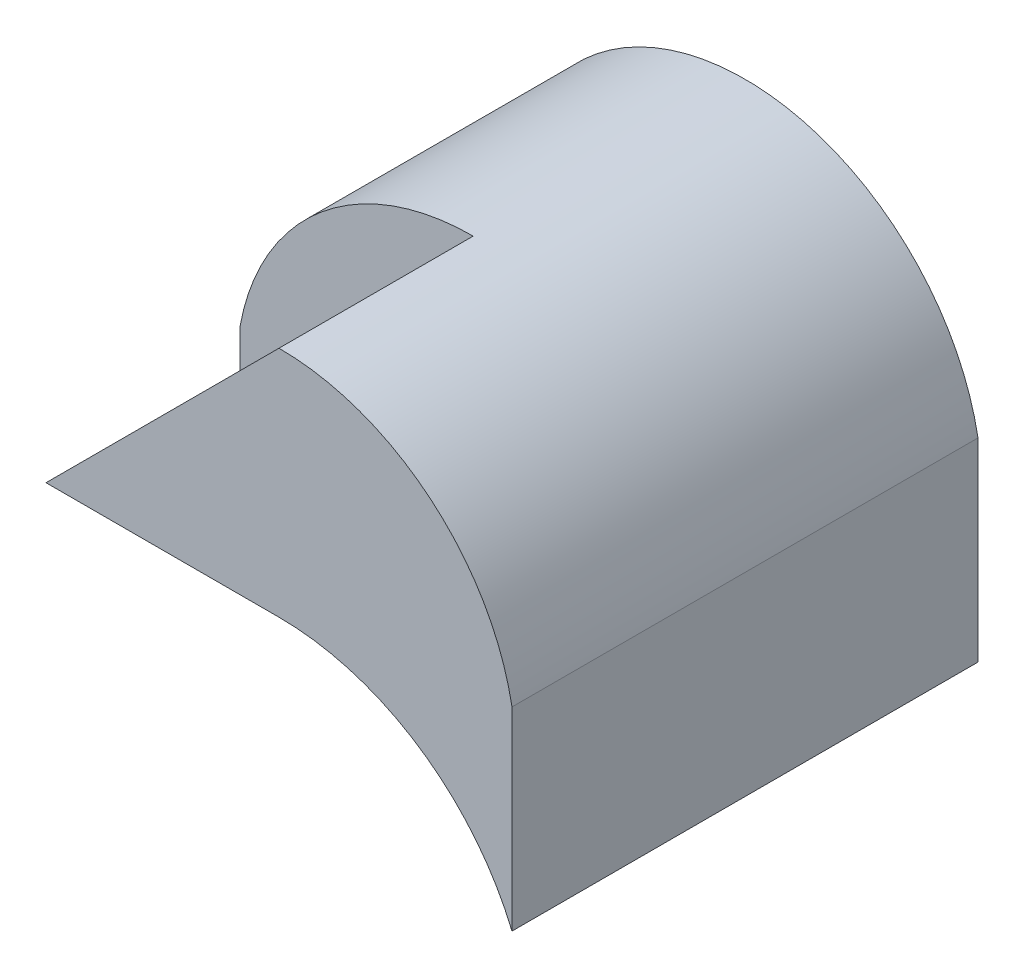
ISO-10303-21;
HEADER;
FILE_DESCRIPTION(('STEP AP214'),'2;1');
FILE_NAME('part.step','',(''),(''),'','','');
FILE_SCHEMA(('AUTOMOTIVE_DESIGN { 1 0 10303 214 1 1 1 1 }'));
ENDSEC;
DATA;
#1=APPLICATION_CONTEXT('core data for automotive mechanical design processes');
#2=APPLICATION_PROTOCOL_DEFINITION('international standard','automotive_design',2000,#1);
#3=PRODUCT_CONTEXT('',#1,'mechanical');
#4=PRODUCT('Part','Part','',(#3));
#5=PRODUCT_RELATED_PRODUCT_CATEGORY('part','',(#4));
#6=PRODUCT_DEFINITION_FORMATION('','',#4);
#7=PRODUCT_DEFINITION_CONTEXT('part definition',#1,'design');
#8=PRODUCT_DEFINITION('design','',#6,#7);
#9=PRODUCT_DEFINITION_SHAPE('','',#8);
#10=(LENGTH_UNIT() NAMED_UNIT(*) SI_UNIT(.MILLI.,.METRE.));
#11=(NAMED_UNIT(*) PLANE_ANGLE_UNIT() SI_UNIT($,.RADIAN.));
#12=(NAMED_UNIT(*) SI_UNIT($,.STERADIAN.) SOLID_ANGLE_UNIT());
#13=UNCERTAINTY_MEASURE_WITH_UNIT(LENGTH_MEASURE(1.E-05),#10,'distance_accuracy_value','');
#14=(GEOMETRIC_REPRESENTATION_CONTEXT(3) GLOBAL_UNCERTAINTY_ASSIGNED_CONTEXT((#13)) GLOBAL_UNIT_ASSIGNED_CONTEXT((#10,
#11,#12)) REPRESENTATION_CONTEXT('',''));
#15=CARTESIAN_POINT('',(0.,0.,0.));
#16=DIRECTION('',(0.,0.,1.));
#17=DIRECTION('',(1.,0.,0.));
#18=AXIS2_PLACEMENT_3D('',#15,#16,#17);
#19=CARTESIAN_POINT('',(-3.,5.,3.));
#20=DIRECTION('',(0.,0.,-1.));
#21=DIRECTION('',(-1.,0.,0.));
#22=AXIS2_PLACEMENT_3D('',#19,#20,#21);
#23=PLANE('',#22);
#24=DIRECTION('',(1.,0.,0.));
#25=VECTOR('',#24,1.);
#26=CARTESIAN_POINT('',(0.,2.,3.));
#27=LINE('',#26,#25);
#28=CARTESIAN_POINT('',(-3.,2.,3.));
#29=VERTEX_POINT('',#28);
#30=CARTESIAN_POINT('',(0.,2.,3.));
#31=VERTEX_POINT('',#30);
#32=EDGE_CURVE('E117',#29,#31,#27,.T.);
#33=ORIENTED_EDGE('',*,*,#32,.T.);
#34=CARTESIAN_POINT('',(0.,-1.25,3.));
#35=DIRECTION('',(0.,0.,1.));
#36=DIRECTION('',(1.,0.,0.));
#37=AXIS2_PLACEMENT_3D('',#34,#35,#36);
#38=CIRCLE('',#37,3.25);
#39=CARTESIAN_POINT('',(3.,0.,3.));
#40=VERTEX_POINT('',#39);
#41=EDGE_CURVE('E152',#31,#40,#38,.F.);
#42=ORIENTED_EDGE('',*,*,#41,.T.);
#43=DIRECTION('',(0.,-1.,0.));
#44=VECTOR('',#43,1.);
#45=CARTESIAN_POINT('',(3.,5.,3.));
#46=LINE('',#45,#44);
#47=CARTESIAN_POINT('',(3.,2.5,3.));
#48=VERTEX_POINT('',#47);
#49=EDGE_CURVE('E166',#48,#40,#46,.T.);
#50=ORIENTED_EDGE('',*,*,#49,.F.);
#51=CARTESIAN_POINT('',(0.,1.95,3.));
#52=DIRECTION('',(0.,0.,1.));
#53=DIRECTION('',(1.,0.,0.));
#54=AXIS2_PLACEMENT_3D('',#51,#52,#53);
#55=CIRCLE('',#54,3.05);
#56=CARTESIAN_POINT('',(0.,5.,3.));
#57=VERTEX_POINT('',#56);
#58=EDGE_CURVE('E157',#57,#48,#55,.F.);
#59=ORIENTED_EDGE('',*,*,#58,.F.);
#60=DIRECTION('',(0.707106781186547,0.707106781186548,0.));
#61=VECTOR('',#60,1.);
#62=CARTESIAN_POINT('',(-2.5,2.5,3.));
#63=LINE('',#62,#61);
#64=EDGE_CURVE('E144',#29,#57,#63,.T.);
#65=ORIENTED_EDGE('',*,*,#64,.F.);
#66=EDGE_LOOP('',(#33,#42,#50,#59,#65));
#67=FACE_BOUND('',#66,.T.);
#68=ADVANCED_FACE('F51',(#67),#23,.F.);
#69=CARTESIAN_POINT('',(-3.,5.,3.));
#70=DIRECTION('',(1.,0.,0.));
#71=DIRECTION('',(0.,0.,-1.));
#72=AXIS2_PLACEMENT_3D('',#69,#70,#71);
#73=PLANE('',#72);
#74=DIRECTION('',(0.,-1.,0.));
#75=VECTOR('',#74,1.);
#76=CARTESIAN_POINT('',(-3.,0.,0.5));
#77=LINE('',#76,#75);
#78=CARTESIAN_POINT('',(-3.,2.,0.5));
#79=VERTEX_POINT('',#78);
#80=CARTESIAN_POINT('',(-3.,0.,0.5));
#81=VERTEX_POINT('',#80);
#82=EDGE_CURVE('E126',#79,#81,#77,.T.);
#83=ORIENTED_EDGE('',*,*,#82,.F.);
#84=DIRECTION('',(0.,-1.,0.));
#85=VECTOR('',#84,1.);
#86=CARTESIAN_POINT('',(-3.,0.,0.5));
#87=LINE('',#86,#85);
#88=CARTESIAN_POINT('',(-3.,2.5,0.5));
#89=VERTEX_POINT('',#88);
#90=EDGE_CURVE('E135',#89,#79,#87,.T.);
#91=ORIENTED_EDGE('',*,*,#90,.F.);
#92=DIRECTION('',(0.,0.,1.));
#93=VECTOR('',#92,1.);
#94=CARTESIAN_POINT('',(-3.,2.5,-9.5));
#95=LINE('',#94,#93);
#96=CARTESIAN_POINT('',(-3.,2.5,-3.));
#97=VERTEX_POINT('',#96);
#98=EDGE_CURVE('E159',#97,#89,#95,.T.);
#99=ORIENTED_EDGE('',*,*,#98,.F.);
#100=DIRECTION('',(0.,-1.,0.));
#101=VECTOR('',#100,1.);
#102=CARTESIAN_POINT('',(-3.,5.,-3.));
#103=LINE('',#102,#101);
#104=CARTESIAN_POINT('',(-3.,0.,-3.));
#105=VERTEX_POINT('',#104);
#106=EDGE_CURVE('E169',#97,#105,#103,.T.);
#107=ORIENTED_EDGE('',*,*,#106,.T.);
#108=DIRECTION('',(0.,0.,1.));
#109=VECTOR('',#108,1.);
#110=CARTESIAN_POINT('',(-3.,0.,3.));
#111=LINE('',#110,#109);
#112=EDGE_CURVE('E137',#105,#81,#111,.T.);
#113=ORIENTED_EDGE('',*,*,#112,.T.);
#114=EDGE_LOOP('',(#83,#91,#99,#107,#113));
#115=FACE_BOUND('',#114,.T.);
#116=ADVANCED_FACE('F134',(#115),#73,.F.);
#117=CARTESIAN_POINT('',(-3.,5.,-3.));
#118=DIRECTION('',(0.,0.,1.));
#119=DIRECTION('',(1.,0.,0.));
#120=AXIS2_PLACEMENT_3D('',#117,#118,#119);
#121=PLANE('',#120);
#122=CARTESIAN_POINT('',(0.,1.95,-3.));
#123=DIRECTION('',(0.,0.,1.));
#124=DIRECTION('',(1.,0.,0.));
#125=AXIS2_PLACEMENT_3D('',#122,#123,#124);
#126=CIRCLE('',#125,3.05);
#127=CARTESIAN_POINT('',(3.,2.5,-3.));
#128=VERTEX_POINT('',#127);
#129=EDGE_CURVE('E74',#97,#128,#126,.F.);
#130=ORIENTED_EDGE('',*,*,#129,.T.);
#131=DIRECTION('',(0.,-1.,0.));
#132=VECTOR('',#131,1.);
#133=CARTESIAN_POINT('',(3.,5.,-3.));
#134=LINE('',#133,#132);
#135=CARTESIAN_POINT('',(3.,0.,-3.));
#136=VERTEX_POINT('',#135);
#137=EDGE_CURVE('E59',#128,#136,#134,.T.);
#138=ORIENTED_EDGE('',*,*,#137,.T.);
#139=CARTESIAN_POINT('',(0.,-1.25,-3.));
#140=DIRECTION('',(0.,0.,1.));
#141=DIRECTION('',(1.,0.,0.));
#142=AXIS2_PLACEMENT_3D('',#139,#140,#141);
#143=CIRCLE('',#142,3.25);
#144=EDGE_CURVE('E155',#105,#136,#143,.F.);
#145=ORIENTED_EDGE('',*,*,#144,.F.);
#146=ORIENTED_EDGE('',*,*,#106,.F.);
#147=EDGE_LOOP('',(#130,#138,#145,#146));
#148=FACE_BOUND('',#147,.T.);
#149=ADVANCED_FACE('F174',(#148),#121,.F.);
#150=CARTESIAN_POINT('',(3.,5.,3.));
#151=DIRECTION('',(-1.,0.,0.));
#152=DIRECTION('',(0.,0.,1.));
#153=AXIS2_PLACEMENT_3D('',#150,#151,#152);
#154=PLANE('',#153);
#155=ORIENTED_EDGE('',*,*,#137,.F.);
#156=DIRECTION('',(0.,0.,1.));
#157=VECTOR('',#156,1.);
#158=CARTESIAN_POINT('',(3.,2.5,-9.5));
#159=LINE('',#158,#157);
#160=EDGE_CURVE('E12',#128,#48,#159,.T.);
#161=ORIENTED_EDGE('',*,*,#160,.T.);
#162=ORIENTED_EDGE('',*,*,#49,.T.);
#163=DIRECTION('',(0.,0.,-1.));
#164=VECTOR('',#163,1.);
#165=CARTESIAN_POINT('',(3.,0.,3.));
#166=LINE('',#165,#164);
#167=EDGE_CURVE('E162',#40,#136,#166,.T.);
#168=ORIENTED_EDGE('',*,*,#167,.T.);
#169=EDGE_LOOP('',(#155,#161,#162,#168));
#170=FACE_BOUND('',#169,.T.);
#171=ADVANCED_FACE('F53',(#170),#154,.F.);
#172=CARTESIAN_POINT('',(0.,1.95,-9.5));
#173=DIRECTION('',(0.,0.,1.));
#174=DIRECTION('',(1.,0.,0.));
#175=AXIS2_PLACEMENT_3D('',#172,#173,#174);
#176=CYLINDRICAL_SURFACE('',#175,3.05);
#177=CARTESIAN_POINT('',(0.,1.95,0.5));
#178=DIRECTION('',(0.,0.,1.));
#179=DIRECTION('',(1.,0.,0.));
#180=AXIS2_PLACEMENT_3D('',#177,#178,#179);
#181=CIRCLE('',#180,3.05);
#182=CARTESIAN_POINT('',(0.,5.,0.5));
#183=VERTEX_POINT('',#182);
#184=EDGE_CURVE('E121',#183,#89,#181,.T.);
#185=ORIENTED_EDGE('',*,*,#184,.F.);
#186=DIRECTION('',(0.,0.,1.));
#187=VECTOR('',#186,1.);
#188=CARTESIAN_POINT('',(0.,5.,0.5));
#189=LINE('',#188,#187);
#190=EDGE_CURVE('E120',#183,#57,#189,.T.);
#191=ORIENTED_EDGE('',*,*,#190,.T.);
#192=ORIENTED_EDGE('',*,*,#58,.T.);
#193=ORIENTED_EDGE('',*,*,#160,.F.);
#194=ORIENTED_EDGE('',*,*,#129,.F.);
#195=ORIENTED_EDGE('',*,*,#98,.T.);
#196=EDGE_LOOP('',(#185,#191,#192,#193,#194,#195));
#197=FACE_BOUND('',#196,.T.);
#198=ADVANCED_FACE('F185',(#197),#176,.T.);
#199=CARTESIAN_POINT('',(0.,-1.25,-9.5));
#200=DIRECTION('',(0.,0.,1.));
#201=DIRECTION('',(1.,0.,0.));
#202=AXIS2_PLACEMENT_3D('',#199,#200,#201);
#203=CYLINDRICAL_SURFACE('',#202,3.25);
#204=DIRECTION('',(0.,0.,1.));
#205=VECTOR('',#204,1.);
#206=CARTESIAN_POINT('',(0.,2.,0.5));
#207=LINE('',#206,#205);
#208=CARTESIAN_POINT('',(0.,2.,0.5));
#209=VERTEX_POINT('',#208);
#210=EDGE_CURVE('E146',#209,#31,#207,.T.);
#211=ORIENTED_EDGE('',*,*,#210,.F.);
#212=CARTESIAN_POINT('',(0.,-1.25,0.5));
#213=DIRECTION('',(0.,0.,1.));
#214=DIRECTION('',(1.,0.,0.));
#215=AXIS2_PLACEMENT_3D('',#212,#213,#214);
#216=CIRCLE('',#215,3.25);
#217=EDGE_CURVE('E128',#81,#209,#216,.F.);
#218=ORIENTED_EDGE('',*,*,#217,.F.);
#219=ORIENTED_EDGE('',*,*,#112,.F.);
#220=ORIENTED_EDGE('',*,*,#144,.T.);
#221=ORIENTED_EDGE('',*,*,#167,.F.);
#222=ORIENTED_EDGE('',*,*,#41,.F.);
#223=EDGE_LOOP('',(#211,#218,#219,#220,#221,#222));
#224=FACE_BOUND('',#223,.T.);
#225=ADVANCED_FACE('F181',(#224),#203,.F.);
#226=CARTESIAN_POINT('',(-2.5,2.5,0.5));
#227=DIRECTION('',(0.707106781186548,-0.707106781186547,0.));
#228=DIRECTION('',(0.707106781186547,0.707106781186548,0.));
#229=AXIS2_PLACEMENT_3D('',#226,#227,#228);
#230=PLANE('',#229);
#231=ORIENTED_EDGE('',*,*,#64,.T.);
#232=ORIENTED_EDGE('',*,*,#190,.F.);
#233=DIRECTION('',(0.707106781186547,0.707106781186548,0.));
#234=VECTOR('',#233,1.);
#235=CARTESIAN_POINT('',(-2.5,2.5,0.5));
#236=LINE('',#235,#234);
#237=EDGE_CURVE('E66',#79,#183,#236,.T.);
#238=ORIENTED_EDGE('',*,*,#237,.F.);
#239=DIRECTION('',(0.,0.,1.));
#240=VECTOR('',#239,1.);
#241=CARTESIAN_POINT('',(-3.,2.,0.5));
#242=LINE('',#241,#240);
#243=EDGE_CURVE('E111',#79,#29,#242,.T.);
#244=ORIENTED_EDGE('',*,*,#243,.T.);
#245=EDGE_LOOP('',(#231,#232,#238,#244));
#246=FACE_BOUND('',#245,.T.);
#247=ADVANCED_FACE('F139',(#246),#230,.F.);
#248=CARTESIAN_POINT('',(0.,0.,0.5));
#249=DIRECTION('',(0.,0.,1.));
#250=DIRECTION('',(1.,0.,0.));
#251=AXIS2_PLACEMENT_3D('',#248,#249,#250);
#252=PLANE('',#251);
#253=ORIENTED_EDGE('',*,*,#90,.T.);
#254=ORIENTED_EDGE('',*,*,#237,.T.);
#255=ORIENTED_EDGE('',*,*,#184,.T.);
#256=EDGE_LOOP('',(#253,#254,#255));
#257=FACE_BOUND('',#256,.T.);
#258=ADVANCED_FACE('F143',(#257),#252,.T.);
#259=CARTESIAN_POINT('',(0.,2.,0.5));
#260=DIRECTION('',(0.,-1.,0.));
#261=DIRECTION('',(0.,0.,-1.));
#262=AXIS2_PLACEMENT_3D('',#259,#260,#261);
#263=PLANE('',#262);
#264=ORIENTED_EDGE('',*,*,#32,.F.);
#265=ORIENTED_EDGE('',*,*,#243,.F.);
#266=DIRECTION('',(1.,0.,0.));
#267=VECTOR('',#266,1.);
#268=CARTESIAN_POINT('',(0.,2.,0.5));
#269=LINE('',#268,#267);
#270=EDGE_CURVE('E114',#79,#209,#269,.T.);
#271=ORIENTED_EDGE('',*,*,#270,.T.);
#272=ORIENTED_EDGE('',*,*,#210,.T.);
#273=EDGE_LOOP('',(#264,#265,#271,#272));
#274=FACE_BOUND('',#273,.T.);
#275=ADVANCED_FACE('F113',(#274),#263,.T.);
#276=CARTESIAN_POINT('',(0.,0.,0.5));
#277=DIRECTION('',(0.,0.,1.));
#278=DIRECTION('',(1.,0.,0.));
#279=AXIS2_PLACEMENT_3D('',#276,#277,#278);
#280=PLANE('',#279);
#281=ORIENTED_EDGE('',*,*,#270,.F.);
#282=ORIENTED_EDGE('',*,*,#82,.T.);
#283=ORIENTED_EDGE('',*,*,#217,.T.);
#284=EDGE_LOOP('',(#281,#282,#283));
#285=FACE_BOUND('',#284,.T.);
#286=ADVANCED_FACE('F125',(#285),#280,.T.);
#287=CLOSED_SHELL('',(#68,#116,#149,#171,#198,#225,#247,#258,#275,#286));
#288=MANIFOLD_SOLID_BREP('B2',#287);
#289=ADVANCED_BREP_SHAPE_REPRESENTATION('',(#18,#288),#14);
#290=SHAPE_DEFINITION_REPRESENTATION(#9,#289);
ENDSEC;
END-ISO-10303-21;
